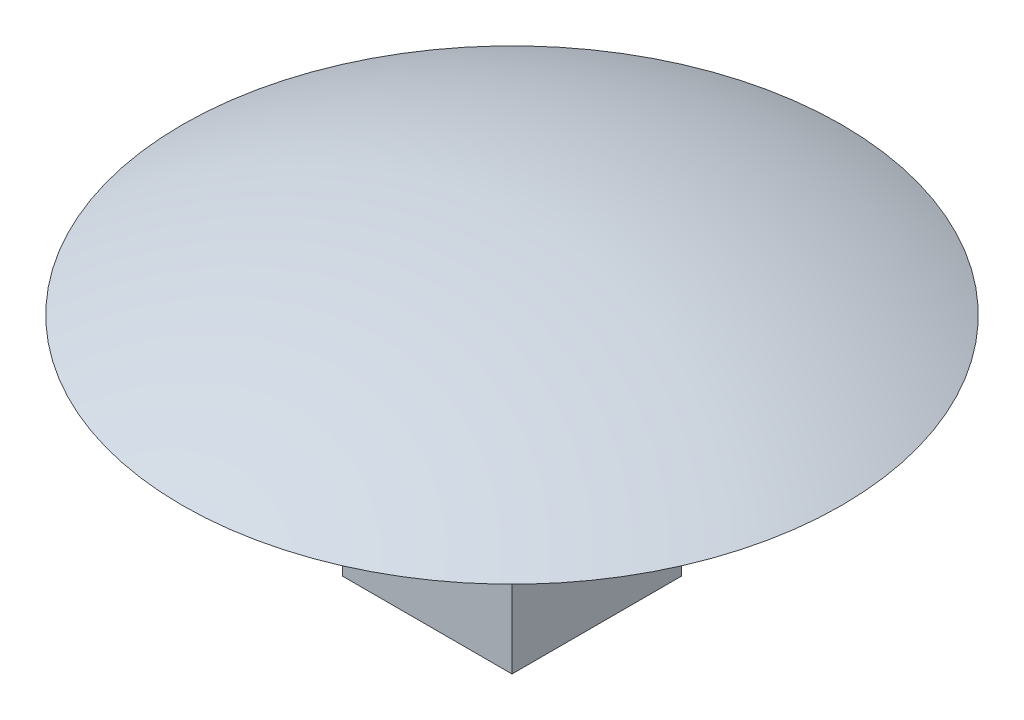
ISO-10303-21;
HEADER;
FILE_DESCRIPTION(('STEP AP214'),'2;1');
FILE_NAME('part.step','',(''),(''),'','','');
FILE_SCHEMA(('AUTOMOTIVE_DESIGN { 1 0 10303 214 1 1 1 1 }'));
ENDSEC;
DATA;
#1=APPLICATION_CONTEXT('core data for automotive mechanical design processes');
#2=APPLICATION_PROTOCOL_DEFINITION('international standard','automotive_design',2000,#1);
#3=PRODUCT_CONTEXT('',#1,'mechanical');
#4=PRODUCT('Part','Part','',(#3));
#5=PRODUCT_RELATED_PRODUCT_CATEGORY('part','',(#4));
#6=PRODUCT_DEFINITION_FORMATION('','',#4);
#7=PRODUCT_DEFINITION_CONTEXT('part definition',#1,'design');
#8=PRODUCT_DEFINITION('design','',#6,#7);
#9=PRODUCT_DEFINITION_SHAPE('','',#8);
#10=(LENGTH_UNIT() NAMED_UNIT(*) SI_UNIT(.MILLI.,.METRE.));
#11=(NAMED_UNIT(*) PLANE_ANGLE_UNIT() SI_UNIT($,.RADIAN.));
#12=(NAMED_UNIT(*) SI_UNIT($,.STERADIAN.) SOLID_ANGLE_UNIT());
#13=UNCERTAINTY_MEASURE_WITH_UNIT(LENGTH_MEASURE(1.E-05),#10,'distance_accuracy_value','');
#14=(GEOMETRIC_REPRESENTATION_CONTEXT(3) GLOBAL_UNCERTAINTY_ASSIGNED_CONTEXT((#13)) GLOBAL_UNIT_ASSIGNED_CONTEXT((#10,
#11,#12)) REPRESENTATION_CONTEXT('',''));
#15=CARTESIAN_POINT('',(0.,0.,0.));
#16=DIRECTION('',(0.,0.,1.));
#17=DIRECTION('',(1.,0.,0.));
#18=AXIS2_PLACEMENT_3D('',#15,#16,#17);
#19=CARTESIAN_POINT('',(0.,0.,0.));
#20=DIRECTION('',(0.,-1.,0.));
#21=DIRECTION('',(0.,0.,-1.));
#22=AXIS2_PLACEMENT_3D('',#19,#20,#21);
#23=PLANE('',#22);
#24=CARTESIAN_POINT('',(0.,0.,0.));
#25=DIRECTION('',(0.,-1.,0.));
#26=DIRECTION('',(0.,0.,-1.));
#27=AXIS2_PLACEMENT_3D('',#24,#25,#26);
#28=CIRCLE('',#27,8.75);
#29=CARTESIAN_POINT('',(0.,0.,-8.75));
#30=VERTEX_POINT('',#29);
#31=EDGE_CURVE('E11',#30,#30,#28,.T.);
#32=ORIENTED_EDGE('',*,*,#31,.T.);
#33=EDGE_LOOP('',(#32));
#34=FACE_BOUND('',#33,.T.);
#35=DIRECTION('',(1.,0.,0.));
#36=VECTOR('',#35,1.);
#37=CARTESIAN_POINT('',(-2.25,0.,-2.25));
#38=LINE('',#37,#36);
#39=CARTESIAN_POINT('',(-2.25,0.,-2.25));
#40=VERTEX_POINT('',#39);
#41=CARTESIAN_POINT('',(2.25,0.,-2.25));
#42=VERTEX_POINT('',#41);
#43=EDGE_CURVE('E91',#40,#42,#38,.T.);
#44=ORIENTED_EDGE('',*,*,#43,.F.);
#45=DIRECTION('',(0.,0.,-1.));
#46=VECTOR('',#45,1.);
#47=CARTESIAN_POINT('',(-2.25,0.,2.25));
#48=LINE('',#47,#46);
#49=CARTESIAN_POINT('',(-2.25,0.,2.25));
#50=VERTEX_POINT('',#49);
#51=EDGE_CURVE('E101',#50,#40,#48,.T.);
#52=ORIENTED_EDGE('',*,*,#51,.F.);
#53=DIRECTION('',(-1.,0.,0.));
#54=VECTOR('',#53,1.);
#55=CARTESIAN_POINT('',(-2.25,0.,2.25));
#56=LINE('',#55,#54);
#57=CARTESIAN_POINT('',(2.25,0.,2.25));
#58=VERTEX_POINT('',#57);
#59=EDGE_CURVE('E72',#58,#50,#56,.T.);
#60=ORIENTED_EDGE('',*,*,#59,.F.);
#61=DIRECTION('',(0.,0.,1.));
#62=VECTOR('',#61,1.);
#63=CARTESIAN_POINT('',(2.25,0.,2.25));
#64=LINE('',#63,#62);
#65=EDGE_CURVE('E105',#42,#58,#64,.T.);
#66=ORIENTED_EDGE('',*,*,#65,.F.);
#67=EDGE_LOOP('',(#44,#52,#60,#66));
#68=FACE_BOUND('',#67,.T.);
#69=ADVANCED_FACE('F36',(#34,#68),#23,.T.);
#70=CARTESIAN_POINT('',(0.,-18.140625,0.));
#71=DIRECTION('',(0.,-1.,0.));
#72=DIRECTION('',(1.,0.,0.));
#73=AXIS2_PLACEMENT_3D('',#70,#71,#72);
#74=SPHERICAL_SURFACE('',#73,20.140625);
#75=ORIENTED_EDGE('',*,*,#31,.F.);
#76=EDGE_LOOP('',(#75));
#77=FACE_BOUND('',#76,.T.);
#78=ADVANCED_FACE('F114',(#77),#74,.T.);
#79=CARTESIAN_POINT('',(-2.25,-6.,2.25));
#80=DIRECTION('',(1.,0.,0.));
#81=DIRECTION('',(0.,0.,-1.));
#82=AXIS2_PLACEMENT_3D('',#79,#80,#81);
#83=PLANE('',#82);
#84=ORIENTED_EDGE('',*,*,#51,.T.);
#85=DIRECTION('',(0.,1.,0.));
#86=VECTOR('',#85,1.);
#87=CARTESIAN_POINT('',(-2.25,-6.,-2.25));
#88=LINE('',#87,#86);
#89=CARTESIAN_POINT('',(-2.25,-6.,-2.25));
#90=VERTEX_POINT('',#89);
#91=EDGE_CURVE('E43',#90,#40,#88,.T.);
#92=ORIENTED_EDGE('',*,*,#91,.F.);
#93=DIRECTION('',(0.,0.,-1.));
#94=VECTOR('',#93,1.);
#95=CARTESIAN_POINT('',(-2.25,-6.,2.25));
#96=LINE('',#95,#94);
#97=CARTESIAN_POINT('',(-2.25,-6.,2.25));
#98=VERTEX_POINT('',#97);
#99=EDGE_CURVE('E84',#98,#90,#96,.T.);
#100=ORIENTED_EDGE('',*,*,#99,.F.);
#101=DIRECTION('',(0.,1.,0.));
#102=VECTOR('',#101,1.);
#103=CARTESIAN_POINT('',(-2.25,-6.,2.25));
#104=LINE('',#103,#102);
#105=EDGE_CURVE('E97',#98,#50,#104,.T.);
#106=ORIENTED_EDGE('',*,*,#105,.T.);
#107=EDGE_LOOP('',(#84,#92,#100,#106));
#108=FACE_BOUND('',#107,.T.);
#109=ADVANCED_FACE('F111',(#108),#83,.F.);
#110=CARTESIAN_POINT('',(-2.25,-6.,-2.25));
#111=DIRECTION('',(0.,0.,1.));
#112=DIRECTION('',(1.,0.,0.));
#113=AXIS2_PLACEMENT_3D('',#110,#111,#112);
#114=PLANE('',#113);
#115=ORIENTED_EDGE('',*,*,#43,.T.);
#116=DIRECTION('',(0.,1.,0.));
#117=VECTOR('',#116,1.);
#118=CARTESIAN_POINT('',(2.25,-6.,-2.25));
#119=LINE('',#118,#117);
#120=CARTESIAN_POINT('',(2.25,-6.,-2.25));
#121=VERTEX_POINT('',#120);
#122=EDGE_CURVE('E88',#121,#42,#119,.T.);
#123=ORIENTED_EDGE('',*,*,#122,.F.);
#124=DIRECTION('',(1.,0.,0.));
#125=VECTOR('',#124,1.);
#126=CARTESIAN_POINT('',(-2.25,-6.,-2.25));
#127=LINE('',#126,#125);
#128=EDGE_CURVE('E79',#90,#121,#127,.T.);
#129=ORIENTED_EDGE('',*,*,#128,.F.);
#130=ORIENTED_EDGE('',*,*,#91,.T.);
#131=EDGE_LOOP('',(#115,#123,#129,#130));
#132=FACE_BOUND('',#131,.T.);
#133=ADVANCED_FACE('F89',(#132),#114,.F.);
#134=CARTESIAN_POINT('',(2.25,-6.,2.25));
#135=DIRECTION('',(-1.,0.,0.));
#136=DIRECTION('',(0.,0.,1.));
#137=AXIS2_PLACEMENT_3D('',#134,#135,#136);
#138=PLANE('',#137);
#139=ORIENTED_EDGE('',*,*,#65,.T.);
#140=DIRECTION('',(0.,1.,0.));
#141=VECTOR('',#140,1.);
#142=CARTESIAN_POINT('',(2.25,-6.,2.25));
#143=LINE('',#142,#141);
#144=CARTESIAN_POINT('',(2.25,-6.,2.25));
#145=VERTEX_POINT('',#144);
#146=EDGE_CURVE('E50',#145,#58,#143,.T.);
#147=ORIENTED_EDGE('',*,*,#146,.F.);
#148=DIRECTION('',(0.,0.,1.));
#149=VECTOR('',#148,1.);
#150=CARTESIAN_POINT('',(2.25,-6.,2.25));
#151=LINE('',#150,#149);
#152=EDGE_CURVE('E82',#121,#145,#151,.T.);
#153=ORIENTED_EDGE('',*,*,#152,.F.);
#154=ORIENTED_EDGE('',*,*,#122,.T.);
#155=EDGE_LOOP('',(#139,#147,#153,#154));
#156=FACE_BOUND('',#155,.T.);
#157=ADVANCED_FACE('F95',(#156),#138,.F.);
#158=CARTESIAN_POINT('',(-2.25,-6.,2.25));
#159=DIRECTION('',(0.,0.,-1.));
#160=DIRECTION('',(-1.,0.,0.));
#161=AXIS2_PLACEMENT_3D('',#158,#159,#160);
#162=PLANE('',#161);
#163=ORIENTED_EDGE('',*,*,#59,.T.);
#164=ORIENTED_EDGE('',*,*,#105,.F.);
#165=DIRECTION('',(-1.,0.,0.));
#166=VECTOR('',#165,1.);
#167=CARTESIAN_POINT('',(-2.25,-6.,2.25));
#168=LINE('',#167,#166);
#169=EDGE_CURVE('E58',#145,#98,#168,.T.);
#170=ORIENTED_EDGE('',*,*,#169,.F.);
#171=ORIENTED_EDGE('',*,*,#146,.T.);
#172=EDGE_LOOP('',(#163,#164,#170,#171));
#173=FACE_BOUND('',#172,.T.);
#174=ADVANCED_FACE('F130',(#173),#162,.F.);
#175=CARTESIAN_POINT('',(-2.25,-6.,-2.25));
#176=DIRECTION('',(0.,-1.,0.));
#177=DIRECTION('',(0.,0.,-1.));
#178=AXIS2_PLACEMENT_3D('',#175,#176,#177);
#179=PLANE('',#178);
#180=ORIENTED_EDGE('',*,*,#99,.T.);
#181=ORIENTED_EDGE('',*,*,#128,.T.);
#182=ORIENTED_EDGE('',*,*,#152,.T.);
#183=ORIENTED_EDGE('',*,*,#169,.T.);
#184=EDGE_LOOP('',(#180,#181,#182,#183));
#185=FACE_BOUND('',#184,.T.);
#186=ADVANCED_FACE('F80',(#185),#179,.T.);
#187=CLOSED_SHELL('',(#69,#78,#109,#133,#157,#174,#186));
#188=MANIFOLD_SOLID_BREP('B2',#187);
#189=ADVANCED_BREP_SHAPE_REPRESENTATION('',(#18,#188),#14);
#190=SHAPE_DEFINITION_REPRESENTATION(#9,#189);
ENDSEC;
END-ISO-10303-21;
